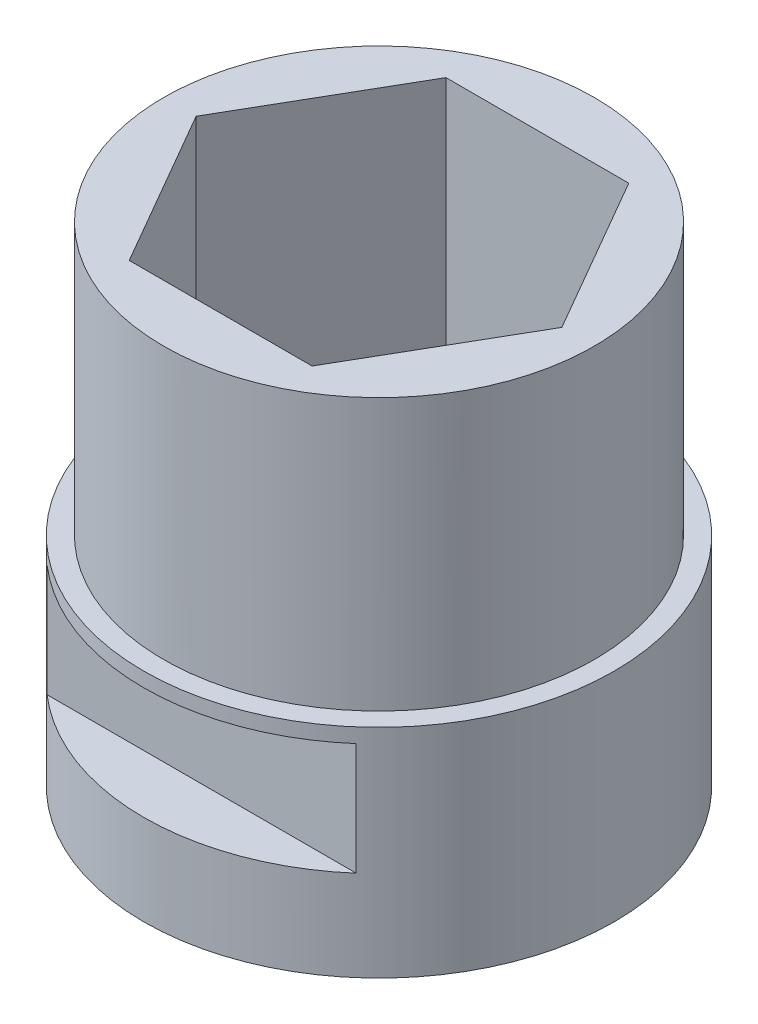
ISO-10303-21;
HEADER;
FILE_DESCRIPTION(('STEP AP214'),'2;1');
FILE_NAME('part.step','',(''),(''),'','','');
FILE_SCHEMA(('AUTOMOTIVE_DESIGN { 1 0 10303 214 1 1 1 1 }'));
ENDSEC;
DATA;
#1=APPLICATION_CONTEXT('core data for automotive mechanical design processes');
#2=APPLICATION_PROTOCOL_DEFINITION('international standard','automotive_design',2000,#1);
#3=PRODUCT_CONTEXT('',#1,'mechanical');
#4=PRODUCT('Part','Part','',(#3));
#5=PRODUCT_RELATED_PRODUCT_CATEGORY('part','',(#4));
#6=PRODUCT_DEFINITION_FORMATION('','',#4);
#7=PRODUCT_DEFINITION_CONTEXT('part definition',#1,'design');
#8=PRODUCT_DEFINITION('design','',#6,#7);
#9=PRODUCT_DEFINITION_SHAPE('','',#8);
#10=(LENGTH_UNIT() NAMED_UNIT(*) SI_UNIT(.MILLI.,.METRE.));
#11=(NAMED_UNIT(*) PLANE_ANGLE_UNIT() SI_UNIT($,.RADIAN.));
#12=(NAMED_UNIT(*) SI_UNIT($,.STERADIAN.) SOLID_ANGLE_UNIT());
#13=UNCERTAINTY_MEASURE_WITH_UNIT(LENGTH_MEASURE(1.E-05),#10,'distance_accuracy_value','');
#14=(GEOMETRIC_REPRESENTATION_CONTEXT(3) GLOBAL_UNCERTAINTY_ASSIGNED_CONTEXT((#13)) GLOBAL_UNIT_ASSIGNED_CONTEXT((#10,
#11,#12)) REPRESENTATION_CONTEXT('',''));
#15=CARTESIAN_POINT('',(0.,0.,0.));
#16=DIRECTION('',(0.,0.,1.));
#17=DIRECTION('',(1.,0.,0.));
#18=AXIS2_PLACEMENT_3D('',#15,#16,#17);
#19=CARTESIAN_POINT('',(0.,16.51,0.));
#20=DIRECTION('',(0.,-1.,0.));
#21=DIRECTION('',(0.,0.,-1.));
#22=AXIS2_PLACEMENT_3D('',#19,#20,#21);
#23=CYLINDRICAL_SURFACE('',#22,7.5565);
#24=CARTESIAN_POINT('',(0.,16.51,0.));
#25=DIRECTION('',(0.,1.,0.));
#26=DIRECTION('',(0.,0.,1.));
#27=AXIS2_PLACEMENT_3D('',#24,#25,#26);
#28=CIRCLE('',#27,7.5565);
#29=CARTESIAN_POINT('',(0.,16.51,7.5565));
#30=VERTEX_POINT('',#29);
#31=EDGE_CURVE('E169',#30,#30,#28,.T.);
#32=ORIENTED_EDGE('',*,*,#31,.F.);
#33=EDGE_LOOP('',(#32));
#34=FACE_BOUND('',#33,.T.);
#35=CARTESIAN_POINT('',(0.,6.985,0.));
#36=DIRECTION('',(0.,-1.,0.));
#37=DIRECTION('',(0.,0.,-1.));
#38=AXIS2_PLACEMENT_3D('',#35,#36,#37);
#39=CIRCLE('',#38,7.5565);
#40=CARTESIAN_POINT('',(0.,6.985,-7.5565));
#41=VERTEX_POINT('',#40);
#42=EDGE_CURVE('E172',#41,#41,#39,.T.);
#43=ORIENTED_EDGE('',*,*,#42,.F.);
#44=EDGE_LOOP('',(#43));
#45=FACE_BOUND('',#44,.T.);
#46=ADVANCED_FACE('F39',(#34,#45),#23,.T.);
#47=CARTESIAN_POINT('',(0.,16.51,0.));
#48=DIRECTION('',(0.,1.,0.));
#49=DIRECTION('',(0.,0.,1.));
#50=AXIS2_PLACEMENT_3D('',#47,#48,#49);
#51=PLANE('',#50);
#52=ORIENTED_EDGE('',*,*,#31,.T.);
#53=EDGE_LOOP('',(#52));
#54=FACE_BOUND('',#53,.T.);
#55=DIRECTION('',(-0.5,0.,0.866025403784439));
#56=VECTOR('',#55,1.);
#57=CARTESIAN_POINT('',(-3.20790243318486,16.51,-5.55625));
#58=LINE('',#57,#56);
#59=CARTESIAN_POINT('',(-3.20790243318486,16.51,-5.55625));
#60=VERTEX_POINT('',#59);
#61=CARTESIAN_POINT('',(-6.41580486636972,16.51,0.));
#62=VERTEX_POINT('',#61);
#63=EDGE_CURVE('E220',#60,#62,#58,.T.);
#64=ORIENTED_EDGE('',*,*,#63,.F.);
#65=DIRECTION('',(-1.,0.,0.));
#66=VECTOR('',#65,1.);
#67=CARTESIAN_POINT('',(3.20790243318486,16.51,-5.55625));
#68=LINE('',#67,#66);
#69=CARTESIAN_POINT('',(3.20790243318486,16.51,-5.55625));
#70=VERTEX_POINT('',#69);
#71=EDGE_CURVE('E195',#70,#60,#68,.T.);
#72=ORIENTED_EDGE('',*,*,#71,.F.);
#73=DIRECTION('',(-0.5,0.,-0.866025403784439));
#74=VECTOR('',#73,1.);
#75=CARTESIAN_POINT('',(6.41580486636972,16.51,0.));
#76=LINE('',#75,#74);
#77=CARTESIAN_POINT('',(6.41580486636972,16.51,0.));
#78=VERTEX_POINT('',#77);
#79=EDGE_CURVE('E191',#78,#70,#76,.T.);
#80=ORIENTED_EDGE('',*,*,#79,.F.);
#81=DIRECTION('',(0.5,0.,-0.866025403784439));
#82=VECTOR('',#81,1.);
#83=CARTESIAN_POINT('',(3.20790243318486,16.51,5.55625));
#84=LINE('',#83,#82);
#85=CARTESIAN_POINT('',(3.20790243318486,16.51,5.55625));
#86=VERTEX_POINT('',#85);
#87=EDGE_CURVE('E213',#86,#78,#84,.T.);
#88=ORIENTED_EDGE('',*,*,#87,.F.);
#89=DIRECTION('',(1.,0.,0.));
#90=VECTOR('',#89,1.);
#91=CARTESIAN_POINT('',(-3.20790243318486,16.51,5.55625));
#92=LINE('',#91,#90);
#93=CARTESIAN_POINT('',(-3.20790243318486,16.51,5.55625));
#94=VERTEX_POINT('',#93);
#95=EDGE_CURVE('E216',#94,#86,#92,.T.);
#96=ORIENTED_EDGE('',*,*,#95,.F.);
#97=DIRECTION('',(0.5,0.,0.866025403784439));
#98=VECTOR('',#97,1.);
#99=CARTESIAN_POINT('',(-6.41580486636972,16.51,0.));
#100=LINE('',#99,#98);
#101=EDGE_CURVE('E218',#62,#94,#100,.T.);
#102=ORIENTED_EDGE('',*,*,#101,.F.);
#103=EDGE_LOOP('',(#64,#72,#80,#88,#96,#102));
#104=FACE_BOUND('',#103,.T.);
#105=ADVANCED_FACE('F159',(#54,#104),#51,.T.);
#106=CARTESIAN_POINT('',(3.20790243318486,16.51,-5.55625));
#107=DIRECTION('',(0.,0.,1.));
#108=DIRECTION('',(1.,0.,0.));
#109=AXIS2_PLACEMENT_3D('',#106,#107,#108);
#110=PLANE('',#109);
#111=DIRECTION('',(-1.,0.,0.));
#112=VECTOR('',#111,1.);
#113=CARTESIAN_POINT('',(3.20790243318486,0.,-5.55625));
#114=LINE('',#113,#112);
#115=CARTESIAN_POINT('',(3.20790243318486,0.,-5.55625));
#116=VERTEX_POINT('',#115);
#117=CARTESIAN_POINT('',(-3.20790243318486,0.,-5.55625));
#118=VERTEX_POINT('',#117);
#119=EDGE_CURVE('E208',#116,#118,#114,.T.);
#120=ORIENTED_EDGE('',*,*,#119,.F.);
#121=DIRECTION('',(0.,-1.,0.));
#122=VECTOR('',#121,1.);
#123=CARTESIAN_POINT('',(3.20790243318486,16.51,-5.55625));
#124=LINE('',#123,#122);
#125=EDGE_CURVE('E189',#70,#116,#124,.T.);
#126=ORIENTED_EDGE('',*,*,#125,.F.);
#127=ORIENTED_EDGE('',*,*,#71,.T.);
#128=DIRECTION('',(0.,-1.,0.));
#129=VECTOR('',#128,1.);
#130=CARTESIAN_POINT('',(-3.20790243318486,16.51,-5.55625));
#131=LINE('',#130,#129);
#132=EDGE_CURVE('E176',#60,#118,#131,.T.);
#133=ORIENTED_EDGE('',*,*,#132,.T.);
#134=EDGE_LOOP('',(#120,#126,#127,#133));
#135=FACE_BOUND('',#134,.T.);
#136=ADVANCED_FACE('F164',(#135),#110,.T.);
#137=CARTESIAN_POINT('',(-3.20790243318486,16.51,-5.55625));
#138=DIRECTION('',(0.866025403784439,0.,0.5));
#139=DIRECTION('',(0.5,0.,-0.866025403784439));
#140=AXIS2_PLACEMENT_3D('',#137,#138,#139);
#141=PLANE('',#140);
#142=DIRECTION('',(-0.5,0.,0.866025403784439));
#143=VECTOR('',#142,1.);
#144=CARTESIAN_POINT('',(-3.20790243318486,0.,-5.55625));
#145=LINE('',#144,#143);
#146=CARTESIAN_POINT('',(-6.41580486636972,0.,0.));
#147=VERTEX_POINT('',#146);
#148=EDGE_CURVE('E205',#118,#147,#145,.T.);
#149=ORIENTED_EDGE('',*,*,#148,.F.);
#150=ORIENTED_EDGE('',*,*,#132,.F.);
#151=ORIENTED_EDGE('',*,*,#63,.T.);
#152=DIRECTION('',(0.,-1.,0.));
#153=VECTOR('',#152,1.);
#154=CARTESIAN_POINT('',(-6.41580486636972,16.51,0.));
#155=LINE('',#154,#153);
#156=EDGE_CURVE('E181',#62,#147,#155,.T.);
#157=ORIENTED_EDGE('',*,*,#156,.T.);
#158=EDGE_LOOP('',(#149,#150,#151,#157));
#159=FACE_BOUND('',#158,.T.);
#160=ADVANCED_FACE('F277',(#159),#141,.T.);
#161=CARTESIAN_POINT('',(-6.41580486636972,16.51,0.));
#162=DIRECTION('',(0.866025403784439,0.,-0.5));
#163=DIRECTION('',(-0.5,0.,-0.866025403784439));
#164=AXIS2_PLACEMENT_3D('',#161,#162,#163);
#165=PLANE('',#164);
#166=DIRECTION('',(0.5,0.,0.866025403784439));
#167=VECTOR('',#166,1.);
#168=CARTESIAN_POINT('',(-6.41580486636972,0.,0.));
#169=LINE('',#168,#167);
#170=CARTESIAN_POINT('',(-3.20790243318486,0.,5.55625));
#171=VERTEX_POINT('',#170);
#172=EDGE_CURVE('E202',#147,#171,#169,.T.);
#173=ORIENTED_EDGE('',*,*,#172,.F.);
#174=ORIENTED_EDGE('',*,*,#156,.F.);
#175=ORIENTED_EDGE('',*,*,#101,.T.);
#176=DIRECTION('',(0.,-1.,0.));
#177=VECTOR('',#176,1.);
#178=CARTESIAN_POINT('',(-3.20790243318486,16.51,5.55625));
#179=LINE('',#178,#177);
#180=EDGE_CURVE('E183',#94,#171,#179,.T.);
#181=ORIENTED_EDGE('',*,*,#180,.T.);
#182=EDGE_LOOP('',(#173,#174,#175,#181));
#183=FACE_BOUND('',#182,.T.);
#184=ADVANCED_FACE('F273',(#183),#165,.T.);
#185=CARTESIAN_POINT('',(-3.20790243318486,16.51,5.55625));
#186=DIRECTION('',(0.,0.,-1.));
#187=DIRECTION('',(-1.,0.,0.));
#188=AXIS2_PLACEMENT_3D('',#185,#186,#187);
#189=PLANE('',#188);
#190=DIRECTION('',(1.,0.,0.));
#191=VECTOR('',#190,1.);
#192=CARTESIAN_POINT('',(-3.20790243318486,0.,5.55625));
#193=LINE('',#192,#191);
#194=CARTESIAN_POINT('',(3.20790243318486,0.,5.55625));
#195=VERTEX_POINT('',#194);
#196=EDGE_CURVE('E199',#171,#195,#193,.T.);
#197=ORIENTED_EDGE('',*,*,#196,.F.);
#198=ORIENTED_EDGE('',*,*,#180,.F.);
#199=ORIENTED_EDGE('',*,*,#95,.T.);
#200=DIRECTION('',(0.,-1.,0.));
#201=VECTOR('',#200,1.);
#202=CARTESIAN_POINT('',(3.20790243318486,16.51,5.55625));
#203=LINE('',#202,#201);
#204=EDGE_CURVE('E185',#86,#195,#203,.T.);
#205=ORIENTED_EDGE('',*,*,#204,.T.);
#206=EDGE_LOOP('',(#197,#198,#199,#205));
#207=FACE_BOUND('',#206,.T.);
#208=ADVANCED_FACE('F269',(#207),#189,.T.);
#209=CARTESIAN_POINT('',(3.20790243318486,16.51,5.55625));
#210=DIRECTION('',(-0.866025403784439,0.,-0.5));
#211=DIRECTION('',(-0.5,0.,0.866025403784439));
#212=AXIS2_PLACEMENT_3D('',#209,#210,#211);
#213=PLANE('',#212);
#214=DIRECTION('',(0.5,0.,-0.866025403784439));
#215=VECTOR('',#214,1.);
#216=CARTESIAN_POINT('',(3.20790243318486,0.,5.55625));
#217=LINE('',#216,#215);
#218=CARTESIAN_POINT('',(6.41580486636972,0.,0.));
#219=VERTEX_POINT('',#218);
#220=EDGE_CURVE('E196',#195,#219,#217,.T.);
#221=ORIENTED_EDGE('',*,*,#220,.F.);
#222=ORIENTED_EDGE('',*,*,#204,.F.);
#223=ORIENTED_EDGE('',*,*,#87,.T.);
#224=DIRECTION('',(0.,-1.,0.));
#225=VECTOR('',#224,1.);
#226=CARTESIAN_POINT('',(6.41580486636972,16.51,0.));
#227=LINE('',#226,#225);
#228=EDGE_CURVE('E187',#78,#219,#227,.T.);
#229=ORIENTED_EDGE('',*,*,#228,.T.);
#230=EDGE_LOOP('',(#221,#222,#223,#229));
#231=FACE_BOUND('',#230,.T.);
#232=ADVANCED_FACE('F265',(#231),#213,.T.);
#233=CARTESIAN_POINT('',(6.41580486636972,16.51,0.));
#234=DIRECTION('',(-0.866025403784439,0.,0.5));
#235=DIRECTION('',(0.5,0.,0.866025403784439));
#236=AXIS2_PLACEMENT_3D('',#233,#234,#235);
#237=PLANE('',#236);
#238=DIRECTION('',(-0.5,0.,-0.866025403784439));
#239=VECTOR('',#238,1.);
#240=CARTESIAN_POINT('',(6.41580486636972,0.,0.));
#241=LINE('',#240,#239);
#242=EDGE_CURVE('E192',#219,#116,#241,.T.);
#243=ORIENTED_EDGE('',*,*,#242,.F.);
#244=ORIENTED_EDGE('',*,*,#228,.F.);
#245=ORIENTED_EDGE('',*,*,#79,.T.);
#246=ORIENTED_EDGE('',*,*,#125,.T.);
#247=EDGE_LOOP('',(#243,#244,#245,#246));
#248=FACE_BOUND('',#247,.T.);
#249=ADVANCED_FACE('F261',(#248),#237,.T.);
#250=CARTESIAN_POINT('',(0.,0.,0.));
#251=DIRECTION('',(0.,-1.,0.));
#252=DIRECTION('',(0.,0.,-1.));
#253=AXIS2_PLACEMENT_3D('',#250,#251,#252);
#254=PLANE('',#253);
#255=CARTESIAN_POINT('',(0.,0.,0.));
#256=DIRECTION('',(0.,-1.,0.));
#257=DIRECTION('',(0.,0.,-1.));
#258=AXIS2_PLACEMENT_3D('',#255,#256,#257);
#259=CIRCLE('',#258,3.3);
#260=CARTESIAN_POINT('',(0.,0.,-3.3));
#261=VERTEX_POINT('',#260);
#262=EDGE_CURVE('E223',#261,#261,#259,.T.);
#263=ORIENTED_EDGE('',*,*,#262,.T.);
#264=EDGE_LOOP('',(#263));
#265=FACE_BOUND('',#264,.T.);
#266=ORIENTED_EDGE('',*,*,#242,.T.);
#267=ORIENTED_EDGE('',*,*,#119,.T.);
#268=ORIENTED_EDGE('',*,*,#148,.T.);
#269=ORIENTED_EDGE('',*,*,#172,.T.);
#270=ORIENTED_EDGE('',*,*,#196,.T.);
#271=ORIENTED_EDGE('',*,*,#220,.T.);
#272=EDGE_LOOP('',(#266,#267,#268,#269,#270,#271));
#273=FACE_BOUND('',#272,.T.);
#274=ADVANCED_FACE('F257',(#265,#273),#254,.F.);
#275=CARTESIAN_POINT('',(0.,-0.635,0.));
#276=DIRECTION('',(0.,-1.,0.));
#277=DIRECTION('',(0.,0.,-1.));
#278=AXIS2_PLACEMENT_3D('',#275,#276,#277);
#279=PLANE('',#278);
#280=CARTESIAN_POINT('',(0.,-0.635,0.));
#281=DIRECTION('',(0.,-1.,0.));
#282=DIRECTION('',(0.,0.,-1.));
#283=AXIS2_PLACEMENT_3D('',#280,#281,#282);
#284=CIRCLE('',#283,3.3);
#285=CARTESIAN_POINT('',(0.,-0.635,-3.3));
#286=VERTEX_POINT('',#285);
#287=EDGE_CURVE('E211',#286,#286,#284,.T.);
#288=ORIENTED_EDGE('',*,*,#287,.F.);
#289=EDGE_LOOP('',(#288));
#290=FACE_BOUND('',#289,.T.);
#291=CARTESIAN_POINT('',(0.,-0.635,0.));
#292=DIRECTION('',(0.,-1.,0.));
#293=DIRECTION('',(0.,0.,-1.));
#294=AXIS2_PLACEMENT_3D('',#291,#292,#293);
#295=CIRCLE('',#294,8.255);
#296=CARTESIAN_POINT('',(0.,-0.635,-8.255));
#297=VERTEX_POINT('',#296);
#298=EDGE_CURVE('E148',#297,#297,#295,.T.);
#299=ORIENTED_EDGE('',*,*,#298,.T.);
#300=EDGE_LOOP('',(#299));
#301=FACE_BOUND('',#300,.T.);
#302=ADVANCED_FACE('F253',(#290,#301),#279,.T.);
#303=CARTESIAN_POINT('',(0.,-0.635,0.));
#304=DIRECTION('',(0.,1.,0.));
#305=DIRECTION('',(0.,0.,1.));
#306=AXIS2_PLACEMENT_3D('',#303,#304,#305);
#307=CYLINDRICAL_SURFACE('',#306,3.3);
#308=ORIENTED_EDGE('',*,*,#287,.T.);
#309=EDGE_LOOP('',(#308));
#310=FACE_BOUND('',#309,.T.);
#311=ORIENTED_EDGE('',*,*,#262,.F.);
#312=EDGE_LOOP('',(#311));
#313=FACE_BOUND('',#312,.T.);
#314=ADVANCED_FACE('F247',(#310,#313),#307,.F.);
#315=CARTESIAN_POINT('',(0.,6.985,0.));
#316=DIRECTION('',(0.,-1.,0.));
#317=DIRECTION('',(0.,0.,-1.));
#318=AXIS2_PLACEMENT_3D('',#315,#316,#317);
#319=CYLINDRICAL_SURFACE('',#318,8.255);
#320=CARTESIAN_POINT('',(0.,6.477,0.));
#321=DIRECTION('',(0.,1.,0.));
#322=DIRECTION('',(0.,0.,1.));
#323=AXIS2_PLACEMENT_3D('',#320,#321,#322);
#324=CIRCLE('',#323,8.255);
#325=CARTESIAN_POINT('',(5.4239557520319,6.477,6.223));
#326=VERTEX_POINT('',#325);
#327=CARTESIAN_POINT('',(-5.4239557520319,6.477,6.223));
#328=VERTEX_POINT('',#327);
#329=EDGE_CURVE('E12',#326,#328,#324,.F.);
#330=ORIENTED_EDGE('',*,*,#329,.F.);
#331=DIRECTION('',(0.,-1.,0.));
#332=VECTOR('',#331,1.);
#333=CARTESIAN_POINT('',(5.4239557520319,6.985,6.223));
#334=LINE('',#333,#332);
#335=CARTESIAN_POINT('',(5.42395575203191,2.54,6.223));
#336=VERTEX_POINT('',#335);
#337=EDGE_CURVE('E46',#336,#326,#334,.F.);
#338=ORIENTED_EDGE('',*,*,#337,.F.);
#339=CARTESIAN_POINT('',(0.,2.54,0.));
#340=DIRECTION('',(0.,-1.,0.));
#341=DIRECTION('',(0.,0.,-1.));
#342=AXIS2_PLACEMENT_3D('',#339,#340,#341);
#343=CIRCLE('',#342,8.255);
#344=CARTESIAN_POINT('',(-5.42395575203191,2.54,6.223));
#345=VERTEX_POINT('',#344);
#346=EDGE_CURVE('E130',#345,#336,#343,.F.);
#347=ORIENTED_EDGE('',*,*,#346,.F.);
#348=DIRECTION('',(0.,-1.,0.));
#349=VECTOR('',#348,1.);
#350=CARTESIAN_POINT('',(-5.4239557520319,6.985,6.223));
#351=LINE('',#350,#349);
#352=EDGE_CURVE('E132',#328,#345,#351,.T.);
#353=ORIENTED_EDGE('',*,*,#352,.F.);
#354=EDGE_LOOP('',(#330,#338,#347,#353));
#355=FACE_BOUND('',#354,.T.);
#356=DIRECTION('',(0.,-1.,0.));
#357=VECTOR('',#356,1.);
#358=CARTESIAN_POINT('',(-5.42395575203191,6.985,-6.223));
#359=LINE('',#358,#357);
#360=CARTESIAN_POINT('',(-5.42395575203191,2.54,-6.223));
#361=VERTEX_POINT('',#360);
#362=CARTESIAN_POINT('',(-5.42395575203191,6.477,-6.223));
#363=VERTEX_POINT('',#362);
#364=EDGE_CURVE('E125',#361,#363,#359,.F.);
#365=ORIENTED_EDGE('',*,*,#364,.F.);
#366=CARTESIAN_POINT('',(0.,2.54,0.));
#367=DIRECTION('',(0.,-1.,0.));
#368=DIRECTION('',(0.,0.,-1.));
#369=AXIS2_PLACEMENT_3D('',#366,#367,#368);
#370=CIRCLE('',#369,8.255);
#371=CARTESIAN_POINT('',(5.42395575203191,2.54,-6.223));
#372=VERTEX_POINT('',#371);
#373=EDGE_CURVE('E114',#372,#361,#370,.F.);
#374=ORIENTED_EDGE('',*,*,#373,.F.);
#375=DIRECTION('',(0.,-1.,0.));
#376=VECTOR('',#375,1.);
#377=CARTESIAN_POINT('',(5.42395575203191,6.985,-6.223));
#378=LINE('',#377,#376);
#379=CARTESIAN_POINT('',(5.42395575203191,6.477,-6.223));
#380=VERTEX_POINT('',#379);
#381=EDGE_CURVE('E122',#380,#372,#378,.T.);
#382=ORIENTED_EDGE('',*,*,#381,.F.);
#383=CARTESIAN_POINT('',(0.,6.477,0.));
#384=DIRECTION('',(0.,1.,0.));
#385=DIRECTION('',(0.,0.,1.));
#386=AXIS2_PLACEMENT_3D('',#383,#384,#385);
#387=CIRCLE('',#386,8.255);
#388=EDGE_CURVE('E121',#363,#380,#387,.F.);
#389=ORIENTED_EDGE('',*,*,#388,.F.);
#390=EDGE_LOOP('',(#365,#374,#382,#389));
#391=FACE_BOUND('',#390,.T.);
#392=CARTESIAN_POINT('',(0.,6.985,0.));
#393=DIRECTION('',(0.,-1.,0.));
#394=DIRECTION('',(0.,0.,-1.));
#395=AXIS2_PLACEMENT_3D('',#392,#393,#394);
#396=CIRCLE('',#395,8.255);
#397=CARTESIAN_POINT('',(0.,6.985,-8.255));
#398=VERTEX_POINT('',#397);
#399=EDGE_CURVE('E226',#398,#398,#396,.T.);
#400=ORIENTED_EDGE('',*,*,#399,.T.);
#401=EDGE_LOOP('',(#400));
#402=FACE_BOUND('',#401,.T.);
#403=ORIENTED_EDGE('',*,*,#298,.F.);
#404=EDGE_LOOP('',(#403));
#405=FACE_BOUND('',#404,.T.);
#406=ADVANCED_FACE('F128',(#355,#391,#402,#405),#319,.T.);
#407=CARTESIAN_POINT('',(0.,6.985,0.));
#408=DIRECTION('',(0.,-1.,0.));
#409=DIRECTION('',(0.,0.,-1.));
#410=AXIS2_PLACEMENT_3D('',#407,#408,#409);
#411=PLANE('',#410);
#412=ORIENTED_EDGE('',*,*,#42,.T.);
#413=EDGE_LOOP('',(#412));
#414=FACE_BOUND('',#413,.T.);
#415=ORIENTED_EDGE('',*,*,#399,.F.);
#416=EDGE_LOOP('',(#415));
#417=FACE_BOUND('',#416,.T.);
#418=ADVANCED_FACE('F237',(#414,#417),#411,.F.);
#419=CARTESIAN_POINT('',(-8.255,6.477,-6.223));
#420=DIRECTION('',(0.,1.,0.));
#421=DIRECTION('',(0.,0.,1.));
#422=AXIS2_PLACEMENT_3D('',#419,#420,#421);
#423=PLANE('',#422);
#424=ORIENTED_EDGE('',*,*,#388,.T.);
#425=DIRECTION('',(1.,0.,0.));
#426=VECTOR('',#425,1.);
#427=CARTESIAN_POINT('',(-8.255,6.477,-6.223));
#428=LINE('',#427,#426);
#429=EDGE_CURVE('E60',#363,#380,#428,.T.);
#430=ORIENTED_EDGE('',*,*,#429,.F.);
#431=EDGE_LOOP('',(#424,#430));
#432=FACE_BOUND('',#431,.T.);
#433=ADVANCED_FACE('F239',(#432),#423,.F.);
#434=CARTESIAN_POINT('',(-8.255,2.54,-8.47905548205234));
#435=DIRECTION('',(0.,-1.,0.));
#436=DIRECTION('',(0.,0.,-1.));
#437=AXIS2_PLACEMENT_3D('',#434,#435,#436);
#438=PLANE('',#437);
#439=ORIENTED_EDGE('',*,*,#373,.T.);
#440=DIRECTION('',(1.,0.,0.));
#441=VECTOR('',#440,1.);
#442=CARTESIAN_POINT('',(-8.255,2.54,-6.223));
#443=LINE('',#442,#441);
#444=EDGE_CURVE('E117',#361,#372,#443,.T.);
#445=ORIENTED_EDGE('',*,*,#444,.T.);
#446=EDGE_LOOP('',(#439,#445));
#447=FACE_BOUND('',#446,.T.);
#448=ADVANCED_FACE('F116',(#447),#438,.F.);
#449=CARTESIAN_POINT('',(-8.255,6.477,-6.223));
#450=DIRECTION('',(0.,0.,1.));
#451=DIRECTION('',(0.,-1.,0.));
#452=AXIS2_PLACEMENT_3D('',#449,#450,#451);
#453=PLANE('',#452);
#454=ORIENTED_EDGE('',*,*,#364,.T.);
#455=ORIENTED_EDGE('',*,*,#429,.T.);
#456=ORIENTED_EDGE('',*,*,#381,.T.);
#457=ORIENTED_EDGE('',*,*,#444,.F.);
#458=EDGE_LOOP('',(#454,#455,#456,#457));
#459=FACE_BOUND('',#458,.T.);
#460=ADVANCED_FACE('F124',(#459),#453,.F.);
#461=CARTESIAN_POINT('',(-8.255,6.477,6.223));
#462=DIRECTION('',(0.,1.,0.));
#463=DIRECTION('',(0.,0.,1.));
#464=AXIS2_PLACEMENT_3D('',#461,#462,#463);
#465=PLANE('',#464);
#466=ORIENTED_EDGE('',*,*,#329,.T.);
#467=DIRECTION('',(1.,0.,0.));
#468=VECTOR('',#467,1.);
#469=CARTESIAN_POINT('',(-8.255,6.477,6.223));
#470=LINE('',#469,#468);
#471=EDGE_CURVE('E141',#328,#326,#470,.T.);
#472=ORIENTED_EDGE('',*,*,#471,.T.);
#473=EDGE_LOOP('',(#466,#472));
#474=FACE_BOUND('',#473,.T.);
#475=ADVANCED_FACE('F147',(#474),#465,.F.);
#476=CARTESIAN_POINT('',(-8.255,6.477,6.223));
#477=DIRECTION('',(0.,0.,-1.));
#478=DIRECTION('',(0.,1.,0.));
#479=AXIS2_PLACEMENT_3D('',#476,#477,#478);
#480=PLANE('',#479);
#481=ORIENTED_EDGE('',*,*,#337,.T.);
#482=ORIENTED_EDGE('',*,*,#471,.F.);
#483=ORIENTED_EDGE('',*,*,#352,.T.);
#484=DIRECTION('',(1.,0.,0.));
#485=VECTOR('',#484,1.);
#486=CARTESIAN_POINT('',(-8.255,2.54,6.223));
#487=LINE('',#486,#485);
#488=EDGE_CURVE('E52',#345,#336,#487,.T.);
#489=ORIENTED_EDGE('',*,*,#488,.T.);
#490=EDGE_LOOP('',(#481,#482,#483,#489));
#491=FACE_BOUND('',#490,.T.);
#492=ADVANCED_FACE('F140',(#491),#480,.F.);
#493=CARTESIAN_POINT('',(-8.255,2.54,8.79581465624032));
#494=DIRECTION('',(0.,-1.,0.));
#495=DIRECTION('',(0.,0.,-1.));
#496=AXIS2_PLACEMENT_3D('',#493,#494,#495);
#497=PLANE('',#496);
#498=ORIENTED_EDGE('',*,*,#346,.T.);
#499=ORIENTED_EDGE('',*,*,#488,.F.);
#500=EDGE_LOOP('',(#498,#499));
#501=FACE_BOUND('',#500,.T.);
#502=ADVANCED_FACE('F150',(#501),#497,.F.);
#503=CLOSED_SHELL('',(#46,#105,#136,#160,#184,#208,#232,#249,#274,#302,#314,#406,#418,#433,#448,
#460,#475,#492,#502));
#504=MANIFOLD_SOLID_BREP('B2',#503);
#505=ADVANCED_BREP_SHAPE_REPRESENTATION('',(#18,#504),#14);
#506=SHAPE_DEFINITION_REPRESENTATION(#9,#505);
ENDSEC;
END-ISO-10303-21;
